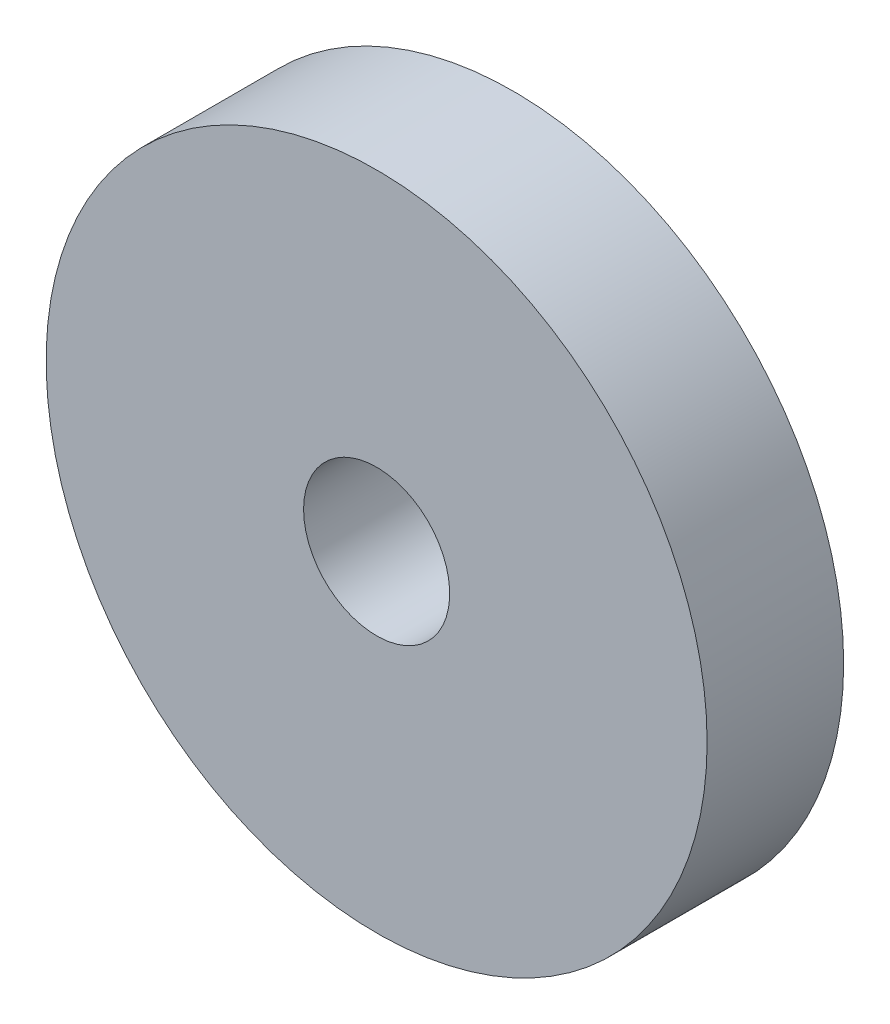
ISO-10303-21;
HEADER;
FILE_DESCRIPTION(('STEP AP214'),'2;1');
FILE_NAME('part.step','',(''),(''),'','','');
FILE_SCHEMA(('AUTOMOTIVE_DESIGN { 1 0 10303 214 1 1 1 1 }'));
ENDSEC;
DATA;
#1=APPLICATION_CONTEXT('core data for automotive mechanical design processes');
#2=APPLICATION_PROTOCOL_DEFINITION('international standard','automotive_design',2000,#1);
#3=PRODUCT_CONTEXT('',#1,'mechanical');
#4=PRODUCT('Part','Part','',(#3));
#5=PRODUCT_RELATED_PRODUCT_CATEGORY('part','',(#4));
#6=PRODUCT_DEFINITION_FORMATION('','',#4);
#7=PRODUCT_DEFINITION_CONTEXT('part definition',#1,'design');
#8=PRODUCT_DEFINITION('design','',#6,#7);
#9=PRODUCT_DEFINITION_SHAPE('','',#8);
#10=(LENGTH_UNIT() NAMED_UNIT(*) SI_UNIT(.MILLI.,.METRE.));
#11=(NAMED_UNIT(*) PLANE_ANGLE_UNIT() SI_UNIT($,.RADIAN.));
#12=(NAMED_UNIT(*) SI_UNIT($,.STERADIAN.) SOLID_ANGLE_UNIT());
#13=UNCERTAINTY_MEASURE_WITH_UNIT(LENGTH_MEASURE(1.E-05),#10,'distance_accuracy_value','');
#14=(GEOMETRIC_REPRESENTATION_CONTEXT(3) GLOBAL_UNCERTAINTY_ASSIGNED_CONTEXT((#13)) GLOBAL_UNIT_ASSIGNED_CONTEXT((#10,
#11,#12)) REPRESENTATION_CONTEXT('',''));
#15=CARTESIAN_POINT('',(0.,0.,0.));
#16=DIRECTION('',(0.,0.,1.));
#17=DIRECTION('',(1.,0.,0.));
#18=AXIS2_PLACEMENT_3D('',#15,#16,#17);
#19=CARTESIAN_POINT('',(0.,189.,58.69));
#20=DIRECTION('',(0.,0.,1.));
#21=DIRECTION('',(1.,0.,0.));
#22=AXIS2_PLACEMENT_3D('',#19,#20,#21);
#23=PLANE('',#22);
#24=CARTESIAN_POINT('',(0.,189.,58.69));
#25=DIRECTION('',(0.,0.,-1.));
#26=DIRECTION('',(-1.,0.,0.));
#27=AXIS2_PLACEMENT_3D('',#24,#25,#26);
#28=CIRCLE('',#27,4.2);
#29=CARTESIAN_POINT('',(-4.2,189.,58.69));
#30=VERTEX_POINT('',#29);
#31=EDGE_CURVE('E26',#30,#30,#28,.T.);
#32=ORIENTED_EDGE('',*,*,#31,.T.);
#33=EDGE_LOOP('',(#32));
#34=FACE_BOUND('',#33,.T.);
#35=CARTESIAN_POINT('',(0.,189.,58.69));
#36=DIRECTION('',(0.,0.,1.));
#37=DIRECTION('',(1.,0.,0.));
#38=AXIS2_PLACEMENT_3D('',#35,#36,#37);
#39=CIRCLE('',#38,19.);
#40=CARTESIAN_POINT('',(19.,189.,58.69));
#41=VERTEX_POINT('',#40);
#42=EDGE_CURVE('E17',#41,#41,#39,.F.);
#43=ORIENTED_EDGE('',*,*,#42,.F.);
#44=EDGE_LOOP('',(#43));
#45=FACE_BOUND('',#44,.T.);
#46=ADVANCED_FACE('F14',(#34,#45),#23,.T.);
#47=CARTESIAN_POINT('',(0.,189.,50.84));
#48=DIRECTION('',(0.,0.,1.));
#49=DIRECTION('',(1.,0.,0.));
#50=AXIS2_PLACEMENT_3D('',#47,#48,#49);
#51=CYLINDRICAL_SURFACE('',#50,19.);
#52=CARTESIAN_POINT('',(0.,189.,50.84));
#53=DIRECTION('',(0.,0.,1.));
#54=DIRECTION('',(1.,0.,0.));
#55=AXIS2_PLACEMENT_3D('',#52,#53,#54);
#56=CIRCLE('',#55,19.);
#57=CARTESIAN_POINT('',(19.,189.,50.84));
#58=VERTEX_POINT('',#57);
#59=EDGE_CURVE('E21',#58,#58,#56,.T.);
#60=ORIENTED_EDGE('',*,*,#59,.T.);
#61=EDGE_LOOP('',(#60));
#62=FACE_BOUND('',#61,.T.);
#63=ORIENTED_EDGE('',*,*,#42,.T.);
#64=EDGE_LOOP('',(#63));
#65=FACE_BOUND('',#64,.T.);
#66=ADVANCED_FACE('F34',(#62,#65),#51,.T.);
#67=CARTESIAN_POINT('',(0.,189.,63.287));
#68=DIRECTION('',(0.,0.,-1.));
#69=DIRECTION('',(-1.,0.,0.));
#70=AXIS2_PLACEMENT_3D('',#67,#68,#69);
#71=CYLINDRICAL_SURFACE('',#70,4.2);
#72=CARTESIAN_POINT('',(0.,189.,50.84));
#73=DIRECTION('',(0.,0.,-1.));
#74=DIRECTION('',(-1.,0.,0.));
#75=AXIS2_PLACEMENT_3D('',#72,#73,#74);
#76=CIRCLE('',#75,4.2);
#77=CARTESIAN_POINT('',(-4.2,189.,50.84));
#78=VERTEX_POINT('',#77);
#79=EDGE_CURVE('E10',#78,#78,#76,.T.);
#80=ORIENTED_EDGE('',*,*,#79,.T.);
#81=EDGE_LOOP('',(#80));
#82=FACE_BOUND('',#81,.T.);
#83=ORIENTED_EDGE('',*,*,#31,.F.);
#84=EDGE_LOOP('',(#83));
#85=FACE_BOUND('',#84,.T.);
#86=ADVANCED_FACE('F41',(#82,#85),#71,.F.);
#87=CARTESIAN_POINT('',(0.,189.,50.84));
#88=DIRECTION('',(0.,0.,1.));
#89=DIRECTION('',(1.,0.,0.));
#90=AXIS2_PLACEMENT_3D('',#87,#88,#89);
#91=PLANE('',#90);
#92=ORIENTED_EDGE('',*,*,#79,.F.);
#93=EDGE_LOOP('',(#92));
#94=FACE_BOUND('',#93,.T.);
#95=ORIENTED_EDGE('',*,*,#59,.F.);
#96=EDGE_LOOP('',(#95));
#97=FACE_BOUND('',#96,.T.);
#98=ADVANCED_FACE('F43',(#94,#97),#91,.F.);
#99=CLOSED_SHELL('',(#46,#66,#86,#98));
#100=MANIFOLD_SOLID_BREP('B1',#99);
#101=ADVANCED_BREP_SHAPE_REPRESENTATION('',(#18,#100),#14);
#102=SHAPE_DEFINITION_REPRESENTATION(#9,#101);
ENDSEC;
END-ISO-10303-21;
